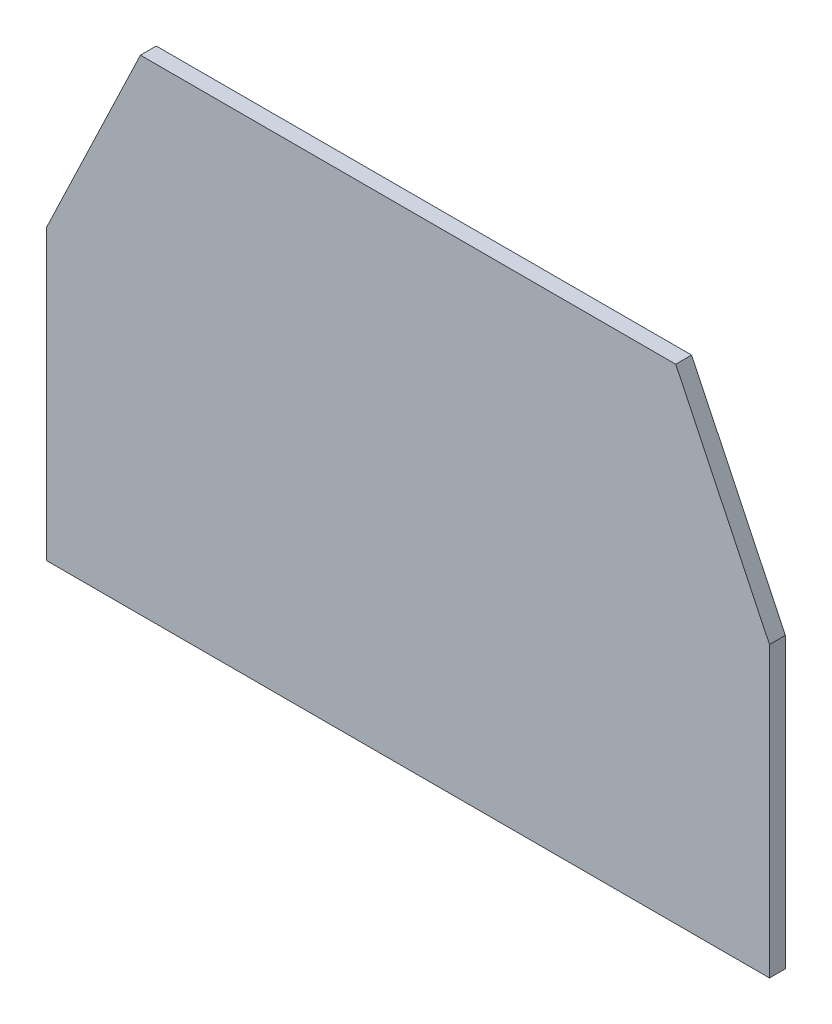
ISO-10303-21;
HEADER;
FILE_DESCRIPTION(('STEP AP214'),'2;1');
FILE_NAME('part.step','',(''),(''),'','','');
FILE_SCHEMA(('AUTOMOTIVE_DESIGN { 1 0 10303 214 1 1 1 1 }'));
ENDSEC;
DATA;
#1=APPLICATION_CONTEXT('core data for automotive mechanical design processes');
#2=APPLICATION_PROTOCOL_DEFINITION('international standard','automotive_design',2000,#1);
#3=PRODUCT_CONTEXT('',#1,'mechanical');
#4=PRODUCT('Part','Part','',(#3));
#5=PRODUCT_RELATED_PRODUCT_CATEGORY('part','',(#4));
#6=PRODUCT_DEFINITION_FORMATION('','',#4);
#7=PRODUCT_DEFINITION_CONTEXT('part definition',#1,'design');
#8=PRODUCT_DEFINITION('design','',#6,#7);
#9=PRODUCT_DEFINITION_SHAPE('','',#8);
#10=(LENGTH_UNIT() NAMED_UNIT(*) SI_UNIT(.MILLI.,.METRE.));
#11=(NAMED_UNIT(*) PLANE_ANGLE_UNIT() SI_UNIT($,.RADIAN.));
#12=(NAMED_UNIT(*) SI_UNIT($,.STERADIAN.) SOLID_ANGLE_UNIT());
#13=UNCERTAINTY_MEASURE_WITH_UNIT(LENGTH_MEASURE(1.E-05),#10,'distance_accuracy_value','');
#14=(GEOMETRIC_REPRESENTATION_CONTEXT(3) GLOBAL_UNCERTAINTY_ASSIGNED_CONTEXT((#13)) GLOBAL_UNIT_ASSIGNED_CONTEXT((#10,
#11,#12)) REPRESENTATION_CONTEXT('',''));
#15=CARTESIAN_POINT('',(0.,0.,0.));
#16=DIRECTION('',(0.,0.,1.));
#17=DIRECTION('',(1.,0.,0.));
#18=AXIS2_PLACEMENT_3D('',#15,#16,#17);
#19=CARTESIAN_POINT('',(-341.858259493534,-194.367647058824,15.));
#20=DIRECTION('',(1.,0.,0.));
#21=DIRECTION('',(0.,1.,0.));
#22=AXIS2_PLACEMENT_3D('',#19,#20,#21);
#23=PLANE('',#22);
#24=DIRECTION('',(0.,-1.,0.));
#25=VECTOR('',#24,1.);
#26=CARTESIAN_POINT('',(-341.858259493534,-194.367647058824,0.));
#27=LINE('',#26,#25);
#28=CARTESIAN_POINT('',(-341.858259493534,78.7945636826585,0.));
#29=VERTEX_POINT('',#28);
#30=CARTESIAN_POINT('',(-341.858259493534,-194.367647058824,0.));
#31=VERTEX_POINT('',#30);
#32=EDGE_CURVE('E117',#29,#31,#27,.T.);
#33=ORIENTED_EDGE('',*,*,#32,.T.);
#34=DIRECTION('',(0.,0.,-1.));
#35=VECTOR('',#34,1.);
#36=CARTESIAN_POINT('',(-341.858259493534,-194.367647058824,15.));
#37=LINE('',#36,#35);
#38=CARTESIAN_POINT('',(-341.858259493534,-194.367647058824,15.));
#39=VERTEX_POINT('',#38);
#40=EDGE_CURVE('E11',#39,#31,#37,.T.);
#41=ORIENTED_EDGE('',*,*,#40,.F.);
#42=DIRECTION('',(0.,-1.,0.));
#43=VECTOR('',#42,1.);
#44=CARTESIAN_POINT('',(-341.858259493534,-194.367647058824,15.));
#45=LINE('',#44,#43);
#46=CARTESIAN_POINT('',(-341.858259493534,78.7945636826585,15.));
#47=VERTEX_POINT('',#46);
#48=EDGE_CURVE('E127',#47,#39,#45,.T.);
#49=ORIENTED_EDGE('',*,*,#48,.F.);
#50=DIRECTION('',(0.,0.,-1.));
#51=VECTOR('',#50,1.);
#52=CARTESIAN_POINT('',(-341.858259493534,78.7945636826585,15.));
#53=LINE('',#52,#51);
#54=EDGE_CURVE('E113',#47,#29,#53,.T.);
#55=ORIENTED_EDGE('',*,*,#54,.T.);
#56=EDGE_LOOP('',(#33,#41,#49,#55));
#57=FACE_BOUND('',#56,.T.);
#58=ADVANCED_FACE('F33',(#57),#23,.F.);
#59=CARTESIAN_POINT('',(341.858259493534,-194.367647058824,15.));
#60=DIRECTION('',(0.,1.,0.));
#61=DIRECTION('',(-1.,0.,0.));
#62=AXIS2_PLACEMENT_3D('',#59,#60,#61);
#63=PLANE('',#62);
#64=DIRECTION('',(1.,0.,0.));
#65=VECTOR('',#64,1.);
#66=CARTESIAN_POINT('',(341.858259493534,-194.367647058824,0.));
#67=LINE('',#66,#65);
#68=CARTESIAN_POINT('',(341.858259493534,-194.367647058824,0.));
#69=VERTEX_POINT('',#68);
#70=EDGE_CURVE('E120',#31,#69,#67,.T.);
#71=ORIENTED_EDGE('',*,*,#70,.T.);
#72=DIRECTION('',(0.,0.,-1.));
#73=VECTOR('',#72,1.);
#74=CARTESIAN_POINT('',(341.858259493534,-194.367647058824,15.));
#75=LINE('',#74,#73);
#76=CARTESIAN_POINT('',(341.858259493534,-194.367647058824,15.));
#77=VERTEX_POINT('',#76);
#78=EDGE_CURVE('E41',#77,#69,#75,.T.);
#79=ORIENTED_EDGE('',*,*,#78,.F.);
#80=DIRECTION('',(1.,0.,0.));
#81=VECTOR('',#80,1.);
#82=CARTESIAN_POINT('',(341.858259493534,-194.367647058824,15.));
#83=LINE('',#82,#81);
#84=EDGE_CURVE('E86',#39,#77,#83,.T.);
#85=ORIENTED_EDGE('',*,*,#84,.F.);
#86=ORIENTED_EDGE('',*,*,#40,.T.);
#87=EDGE_LOOP('',(#71,#79,#85,#86));
#88=FACE_BOUND('',#87,.T.);
#89=ADVANCED_FACE('F151',(#88),#63,.F.);
#90=CARTESIAN_POINT('',(341.858259493534,-194.367647058824,15.));
#91=DIRECTION('',(-1.,0.,0.));
#92=DIRECTION('',(0.,-1.,0.));
#93=AXIS2_PLACEMENT_3D('',#90,#91,#92);
#94=PLANE('',#93);
#95=DIRECTION('',(0.,1.,0.));
#96=VECTOR('',#95,1.);
#97=CARTESIAN_POINT('',(341.858259493534,-194.367647058824,0.));
#98=LINE('',#97,#96);
#99=CARTESIAN_POINT('',(341.858259493534,78.7945636826585,0.));
#100=VERTEX_POINT('',#99);
#101=EDGE_CURVE('E122',#69,#100,#98,.T.);
#102=ORIENTED_EDGE('',*,*,#101,.T.);
#103=DIRECTION('',(0.,0.,-1.));
#104=VECTOR('',#103,1.);
#105=CARTESIAN_POINT('',(341.858259493534,78.7945636826585,15.));
#106=LINE('',#105,#104);
#107=CARTESIAN_POINT('',(341.858259493534,78.7945636826585,15.));
#108=VERTEX_POINT('',#107);
#109=EDGE_CURVE('E108',#108,#100,#106,.T.);
#110=ORIENTED_EDGE('',*,*,#109,.F.);
#111=DIRECTION('',(0.,1.,0.));
#112=VECTOR('',#111,1.);
#113=CARTESIAN_POINT('',(341.858259493534,-194.367647058824,15.));
#114=LINE('',#113,#112);
#115=EDGE_CURVE('E99',#77,#108,#114,.T.);
#116=ORIENTED_EDGE('',*,*,#115,.F.);
#117=ORIENTED_EDGE('',*,*,#78,.T.);
#118=EDGE_LOOP('',(#102,#110,#116,#117));
#119=FACE_BOUND('',#118,.T.);
#120=ADVANCED_FACE('F133',(#119),#94,.F.);
#121=CARTESIAN_POINT('',(341.858259493534,78.7945636826585,15.));
#122=DIRECTION('',(-0.901919134345837,-0.431904937574063,0.));
#123=DIRECTION('',(0.431904937574063,-0.901919134345838,0.));
#124=AXIS2_PLACEMENT_3D('',#121,#122,#123);
#125=PLANE('',#124);
#126=DIRECTION('',(-0.431904937574063,0.901919134345837,0.));
#127=VECTOR('',#126,1.);
#128=CARTESIAN_POINT('',(341.858259493534,78.7945636826585,0.));
#129=LINE('',#128,#127);
#130=CARTESIAN_POINT('',(253.156995608474,264.023673560284,0.));
#131=VERTEX_POINT('',#130);
#132=EDGE_CURVE('E107',#100,#131,#129,.T.);
#133=ORIENTED_EDGE('',*,*,#132,.T.);
#134=DIRECTION('',(0.,0.,-1.));
#135=VECTOR('',#134,1.);
#136=CARTESIAN_POINT('',(253.156995608474,264.023673560284,15.));
#137=LINE('',#136,#135);
#138=CARTESIAN_POINT('',(253.156995608474,264.023673560284,15.));
#139=VERTEX_POINT('',#138);
#140=EDGE_CURVE('E104',#139,#131,#137,.T.);
#141=ORIENTED_EDGE('',*,*,#140,.F.);
#142=DIRECTION('',(-0.431904937574063,0.901919134345837,0.));
#143=VECTOR('',#142,1.);
#144=CARTESIAN_POINT('',(341.858259493534,78.7945636826585,15.));
#145=LINE('',#144,#143);
#146=EDGE_CURVE('E93',#108,#139,#145,.T.);
#147=ORIENTED_EDGE('',*,*,#146,.F.);
#148=ORIENTED_EDGE('',*,*,#109,.T.);
#149=EDGE_LOOP('',(#133,#141,#147,#148));
#150=FACE_BOUND('',#149,.T.);
#151=ADVANCED_FACE('F105',(#150),#125,.F.);
#152=CARTESIAN_POINT('',(253.156995608474,264.023673560284,15.));
#153=DIRECTION('',(0.,-1.,0.));
#154=DIRECTION('',(1.,0.,0.));
#155=AXIS2_PLACEMENT_3D('',#152,#153,#154);
#156=PLANE('',#155);
#157=DIRECTION('',(-1.,0.,0.));
#158=VECTOR('',#157,1.);
#159=CARTESIAN_POINT('',(253.156995608474,264.023673560284,0.));
#160=LINE('',#159,#158);
#161=CARTESIAN_POINT('',(-253.156995608474,264.023673560284,0.));
#162=VERTEX_POINT('',#161);
#163=EDGE_CURVE('E72',#131,#162,#160,.T.);
#164=ORIENTED_EDGE('',*,*,#163,.T.);
#165=DIRECTION('',(0.,0.,-1.));
#166=VECTOR('',#165,1.);
#167=CARTESIAN_POINT('',(-253.156995608474,264.023673560284,15.));
#168=LINE('',#167,#166);
#169=CARTESIAN_POINT('',(-253.156995608474,264.023673560284,15.));
#170=VERTEX_POINT('',#169);
#171=EDGE_CURVE('E109',#170,#162,#168,.T.);
#172=ORIENTED_EDGE('',*,*,#171,.F.);
#173=DIRECTION('',(-1.,0.,0.));
#174=VECTOR('',#173,1.);
#175=CARTESIAN_POINT('',(253.156995608474,264.023673560284,15.));
#176=LINE('',#175,#174);
#177=EDGE_CURVE('E97',#139,#170,#176,.T.);
#178=ORIENTED_EDGE('',*,*,#177,.F.);
#179=ORIENTED_EDGE('',*,*,#140,.T.);
#180=EDGE_LOOP('',(#164,#172,#178,#179));
#181=FACE_BOUND('',#180,.T.);
#182=ADVANCED_FACE('F111',(#181),#156,.F.);
#183=CARTESIAN_POINT('',(-341.858259493534,78.7945636826585,15.));
#184=DIRECTION('',(0.901919134345837,-0.431904937574063,0.));
#185=DIRECTION('',(0.431904937574063,0.901919134345838,0.));
#186=AXIS2_PLACEMENT_3D('',#183,#184,#185);
#187=PLANE('',#186);
#188=DIRECTION('',(-0.431904937574063,-0.901919134345837,0.));
#189=VECTOR('',#188,1.);
#190=CARTESIAN_POINT('',(-341.858259493534,78.7945636826585,0.));
#191=LINE('',#190,#189);
#192=EDGE_CURVE('E78',#162,#29,#191,.T.);
#193=ORIENTED_EDGE('',*,*,#192,.T.);
#194=ORIENTED_EDGE('',*,*,#54,.F.);
#195=DIRECTION('',(-0.431904937574063,-0.901919134345837,0.));
#196=VECTOR('',#195,1.);
#197=CARTESIAN_POINT('',(-341.858259493534,78.7945636826585,15.));
#198=LINE('',#197,#196);
#199=EDGE_CURVE('E49',#170,#47,#198,.T.);
#200=ORIENTED_EDGE('',*,*,#199,.F.);
#201=ORIENTED_EDGE('',*,*,#171,.T.);
#202=EDGE_LOOP('',(#193,#194,#200,#201));
#203=FACE_BOUND('',#202,.T.);
#204=ADVANCED_FACE('F140',(#203),#187,.F.);
#205=CARTESIAN_POINT('',(0.,0.,15.));
#206=DIRECTION('',(0.,0.,1.));
#207=DIRECTION('',(1.,0.,0.));
#208=AXIS2_PLACEMENT_3D('',#205,#206,#207);
#209=PLANE('',#208);
#210=ORIENTED_EDGE('',*,*,#48,.T.);
#211=ORIENTED_EDGE('',*,*,#84,.T.);
#212=ORIENTED_EDGE('',*,*,#115,.T.);
#213=ORIENTED_EDGE('',*,*,#146,.T.);
#214=ORIENTED_EDGE('',*,*,#177,.T.);
#215=ORIENTED_EDGE('',*,*,#199,.T.);
#216=EDGE_LOOP('',(#210,#211,#212,#213,#214,#215));
#217=FACE_BOUND('',#216,.T.);
#218=ADVANCED_FACE('F95',(#217),#209,.T.);
#219=CARTESIAN_POINT('',(0.,0.,0.));
#220=DIRECTION('',(0.,0.,1.));
#221=DIRECTION('',(1.,0.,0.));
#222=AXIS2_PLACEMENT_3D('',#219,#220,#221);
#223=PLANE('',#222);
#224=ORIENTED_EDGE('',*,*,#32,.F.);
#225=ORIENTED_EDGE('',*,*,#192,.F.);
#226=ORIENTED_EDGE('',*,*,#163,.F.);
#227=ORIENTED_EDGE('',*,*,#132,.F.);
#228=ORIENTED_EDGE('',*,*,#101,.F.);
#229=ORIENTED_EDGE('',*,*,#70,.F.);
#230=EDGE_LOOP('',(#224,#225,#226,#227,#228,#229));
#231=FACE_BOUND('',#230,.T.);
#232=ADVANCED_FACE('F136',(#231),#223,.F.);
#233=CLOSED_SHELL('',(#58,#89,#120,#151,#182,#204,#218,#232));
#234=MANIFOLD_SOLID_BREP('B2',#233);
#235=ADVANCED_BREP_SHAPE_REPRESENTATION('',(#18,#234),#14);
#236=SHAPE_DEFINITION_REPRESENTATION(#9,#235);
ENDSEC;
END-ISO-10303-21;
